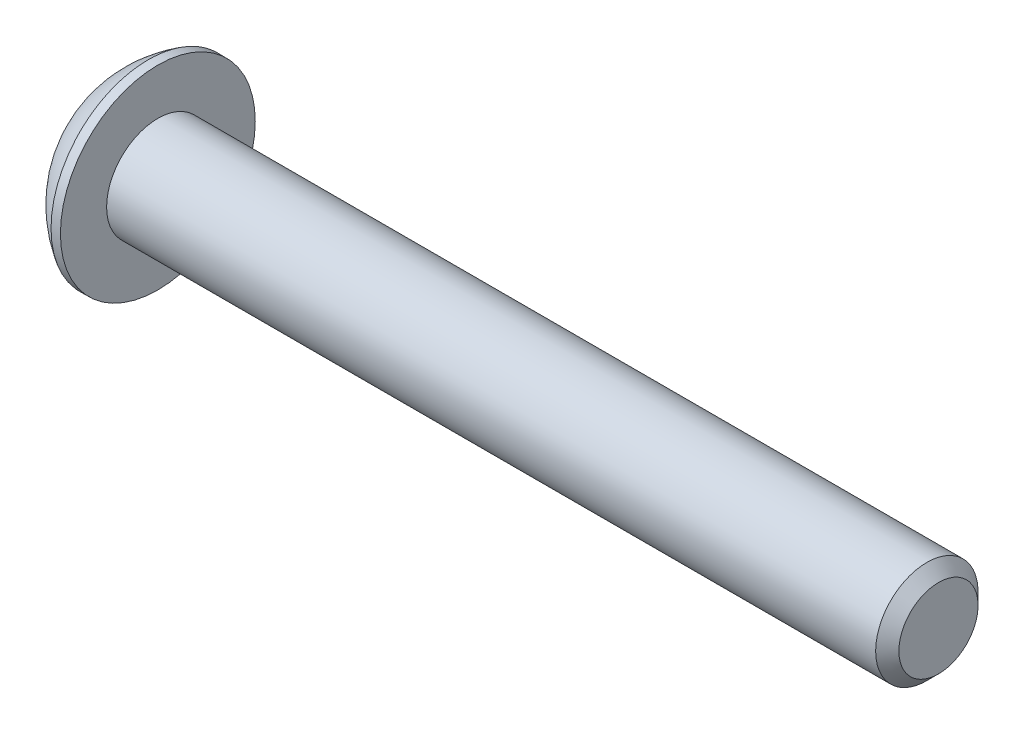
ISO-10303-21;
HEADER;
FILE_DESCRIPTION(('STEP AP214'),'2;1');
FILE_NAME('part.step','',(''),(''),'','','');
FILE_SCHEMA(('AUTOMOTIVE_DESIGN { 1 0 10303 214 1 1 1 1 }'));
ENDSEC;
DATA;
#1=APPLICATION_CONTEXT('core data for automotive mechanical design processes');
#2=APPLICATION_PROTOCOL_DEFINITION('international standard','automotive_design',2000,#1);
#3=PRODUCT_CONTEXT('',#1,'mechanical');
#4=PRODUCT('Part','Part','',(#3));
#5=PRODUCT_RELATED_PRODUCT_CATEGORY('part','',(#4));
#6=PRODUCT_DEFINITION_FORMATION('','',#4);
#7=PRODUCT_DEFINITION_CONTEXT('part definition',#1,'design');
#8=PRODUCT_DEFINITION('design','',#6,#7);
#9=PRODUCT_DEFINITION_SHAPE('','',#8);
#10=(LENGTH_UNIT() NAMED_UNIT(*) SI_UNIT(.MILLI.,.METRE.));
#11=(NAMED_UNIT(*) PLANE_ANGLE_UNIT() SI_UNIT($,.RADIAN.));
#12=(NAMED_UNIT(*) SI_UNIT($,.STERADIAN.) SOLID_ANGLE_UNIT());
#13=UNCERTAINTY_MEASURE_WITH_UNIT(LENGTH_MEASURE(1.E-05),#10,'distance_accuracy_value','');
#14=(GEOMETRIC_REPRESENTATION_CONTEXT(3) GLOBAL_UNCERTAINTY_ASSIGNED_CONTEXT((#13)) GLOBAL_UNIT_ASSIGNED_CONTEXT((#10,
#11,#12)) REPRESENTATION_CONTEXT('',''));
#15=CARTESIAN_POINT('',(0.,0.,0.));
#16=DIRECTION('',(0.,0.,1.));
#17=DIRECTION('',(1.,0.,0.));
#18=AXIS2_PLACEMENT_3D('',#15,#16,#17);
#19=CARTESIAN_POINT('',(1.32080000000034,0.,0.));
#20=DIRECTION('',(-1.,0.,0.));
#21=DIRECTION('',(0.,0.,1.));
#22=AXIS2_PLACEMENT_3D('',#19,#20,#21);
#23=CONICAL_SURFACE('',#22,1.1937999999998,1.04719755119608);
#24=CARTESIAN_POINT('',(2.01004075135902,0.,4.44089209850063E-13));
#25=VERTEX_POINT('',#24);
#26=VERTEX_LOOP('',#25);
#27=FACE_BOUND('',#26,.T.);
#28=CARTESIAN_POINT('',(1.32080000000009,0.,0.));
#29=DIRECTION('',(-1.,0.,0.));
#30=DIRECTION('',(0.,0.,1.));
#31=AXIS2_PLACEMENT_3D('',#28,#29,#30);
#32=CIRCLE('',#31,1.19380000000024);
#33=CARTESIAN_POINT('',(1.32080000000004,-1.03386112703797,0.596900000000061));
#34=VERTEX_POINT('',#33);
#35=CARTESIAN_POINT('',(1.32080000000004,0.,1.19380000000012));
#36=VERTEX_POINT('',#35);
#37=EDGE_CURVE('E20',#34,#36,#32,.T.);
#38=ORIENTED_EDGE('',*,*,#37,.T.);
#39=CARTESIAN_POINT('',(1.32080000000009,0.,0.));
#40=DIRECTION('',(-1.,0.,0.));
#41=DIRECTION('',(0.,0.,1.));
#42=AXIS2_PLACEMENT_3D('',#39,#40,#41);
#43=CIRCLE('',#42,1.19380000000024);
#44=CARTESIAN_POINT('',(1.32080000000004,1.03386112703797,0.59690000000006));
#45=VERTEX_POINT('',#44);
#46=EDGE_CURVE('E148',#36,#45,#43,.T.);
#47=ORIENTED_EDGE('',*,*,#46,.T.);
#48=CARTESIAN_POINT('',(1.32080000000009,0.,0.));
#49=DIRECTION('',(-1.,0.,0.));
#50=DIRECTION('',(0.,0.,1.));
#51=AXIS2_PLACEMENT_3D('',#48,#49,#50);
#52=CIRCLE('',#51,1.19380000000024);
#53=CARTESIAN_POINT('',(1.32080000000004,1.03386112703797,-0.59690000000006));
#54=VERTEX_POINT('',#53);
#55=EDGE_CURVE('E445',#45,#54,#52,.T.);
#56=ORIENTED_EDGE('',*,*,#55,.T.);
#57=CARTESIAN_POINT('',(1.32080000000009,0.,0.));
#58=DIRECTION('',(-1.,0.,0.));
#59=DIRECTION('',(0.,0.,1.));
#60=AXIS2_PLACEMENT_3D('',#57,#58,#59);
#61=CIRCLE('',#60,1.19380000000024);
#62=CARTESIAN_POINT('',(1.32080000000004,1.49457637585666E-12,-1.19380000000012));
#63=VERTEX_POINT('',#62);
#64=EDGE_CURVE('E446',#54,#63,#61,.T.);
#65=ORIENTED_EDGE('',*,*,#64,.T.);
#66=CARTESIAN_POINT('',(1.32080000000009,0.,0.));
#67=DIRECTION('',(-1.,0.,0.));
#68=DIRECTION('',(0.,0.,1.));
#69=AXIS2_PLACEMENT_3D('',#66,#67,#68);
#70=CIRCLE('',#69,1.19380000000024);
#71=CARTESIAN_POINT('',(1.32080000000004,-1.03386112703797,-0.596900000000061));
#72=VERTEX_POINT('',#71);
#73=EDGE_CURVE('E93',#63,#72,#70,.T.);
#74=ORIENTED_EDGE('',*,*,#73,.T.);
#75=CARTESIAN_POINT('',(1.32080000000009,0.,0.));
#76=DIRECTION('',(-1.,0.,0.));
#77=DIRECTION('',(0.,0.,1.));
#78=AXIS2_PLACEMENT_3D('',#75,#76,#77);
#79=CIRCLE('',#78,1.19380000000024);
#80=EDGE_CURVE('E89',#72,#34,#79,.T.);
#81=ORIENTED_EDGE('',*,*,#80,.T.);
#82=EDGE_LOOP('',(#38,#47,#56,#65,#74,#81));
#83=FACE_BOUND('',#82,.T.);
#84=ADVANCED_FACE('F17',(#27,#83),#23,.F.);
#85=CARTESIAN_POINT('',(1.3208,-2.06772225407573,-1.1938));
#86=DIRECTION('',(1.,0.,0.));
#87=DIRECTION('',(0.,0.,-1.));
#88=AXIS2_PLACEMENT_3D('',#85,#86,#87);
#89=PLANE('',#88);
#90=DIRECTION('',(0.,0.5,0.866025403784439));
#91=VECTOR('',#90,1.);
#92=CARTESIAN_POINT('',(1.3208,-1.37848150271715,0.));
#93=LINE('',#92,#91);
#94=CARTESIAN_POINT('',(1.3208,-0.689240751358575,1.1938));
#95=VERTEX_POINT('',#94);
#96=EDGE_CURVE('E101',#95,#34,#93,.F.);
#97=ORIENTED_EDGE('',*,*,#96,.F.);
#98=DIRECTION('',(0.,1.,0.));
#99=VECTOR('',#98,1.);
#100=CARTESIAN_POINT('',(1.3208,-0.689240751358575,1.1938));
#101=LINE('',#100,#99);
#102=EDGE_CURVE('E103',#36,#95,#101,.F.);
#103=ORIENTED_EDGE('',*,*,#102,.F.);
#104=ORIENTED_EDGE('',*,*,#37,.F.);
#105=EDGE_LOOP('',(#97,#103,#104));
#106=FACE_BOUND('',#105,.T.);
#107=ADVANCED_FACE('F99',(#106),#89,.F.);
#108=CARTESIAN_POINT('',(1.3208,-2.06772225407573,-1.1938));
#109=DIRECTION('',(1.,0.,0.));
#110=DIRECTION('',(0.,0.,-1.));
#111=AXIS2_PLACEMENT_3D('',#108,#109,#110);
#112=PLANE('',#111);
#113=DIRECTION('',(0.,-0.5,0.866025403784439));
#114=VECTOR('',#113,1.);
#115=CARTESIAN_POINT('',(1.3208,-0.689240751358575,-1.1938));
#116=LINE('',#115,#114);
#117=CARTESIAN_POINT('',(1.3208,-1.37848150271715,0.));
#118=VERTEX_POINT('',#117);
#119=EDGE_CURVE('E109',#118,#72,#116,.F.);
#120=ORIENTED_EDGE('',*,*,#119,.F.);
#121=DIRECTION('',(0.,0.5,0.866025403784439));
#122=VECTOR('',#121,1.);
#123=CARTESIAN_POINT('',(1.3208,-1.37848150271715,0.));
#124=LINE('',#123,#122);
#125=EDGE_CURVE('E106',#34,#118,#124,.F.);
#126=ORIENTED_EDGE('',*,*,#125,.F.);
#127=ORIENTED_EDGE('',*,*,#80,.F.);
#128=EDGE_LOOP('',(#120,#126,#127));
#129=FACE_BOUND('',#128,.T.);
#130=ADVANCED_FACE('F107',(#129),#112,.F.);
#131=CARTESIAN_POINT('',(1.3208,-2.06772225407573,-1.1938));
#132=DIRECTION('',(1.,0.,0.));
#133=DIRECTION('',(0.,0.,-1.));
#134=AXIS2_PLACEMENT_3D('',#131,#132,#133);
#135=PLANE('',#134);
#136=DIRECTION('',(0.,1.,0.));
#137=VECTOR('',#136,1.);
#138=CARTESIAN_POINT('',(1.3208,0.689240751358575,-1.1938));
#139=LINE('',#138,#137);
#140=CARTESIAN_POINT('',(1.3208,-0.689240751358575,-1.1938));
#141=VERTEX_POINT('',#140);
#142=EDGE_CURVE('E416',#141,#63,#139,.T.);
#143=ORIENTED_EDGE('',*,*,#142,.F.);
#144=DIRECTION('',(0.,-0.5,0.866025403784439));
#145=VECTOR('',#144,1.);
#146=CARTESIAN_POINT('',(1.3208,-0.689240751358575,-1.1938));
#147=LINE('',#146,#145);
#148=EDGE_CURVE('E428',#72,#141,#147,.F.);
#149=ORIENTED_EDGE('',*,*,#148,.F.);
#150=ORIENTED_EDGE('',*,*,#73,.F.);
#151=EDGE_LOOP('',(#143,#149,#150));
#152=FACE_BOUND('',#151,.T.);
#153=ADVANCED_FACE('F191',(#152),#135,.F.);
#154=CARTESIAN_POINT('',(1.3208,-2.06772225407573,-1.1938));
#155=DIRECTION('',(1.,0.,0.));
#156=DIRECTION('',(0.,0.,-1.));
#157=AXIS2_PLACEMENT_3D('',#154,#155,#156);
#158=PLANE('',#157);
#159=DIRECTION('',(0.,-0.499999999999999,-0.866025403784439));
#160=VECTOR('',#159,1.);
#161=CARTESIAN_POINT('',(1.3208,1.37848150271715,0.));
#162=LINE('',#161,#160);
#163=CARTESIAN_POINT('',(1.3208,0.689240751358575,-1.1938));
#164=VERTEX_POINT('',#163);
#165=EDGE_CURVE('E402',#164,#54,#162,.F.);
#166=ORIENTED_EDGE('',*,*,#165,.F.);
#167=DIRECTION('',(0.,1.,0.));
#168=VECTOR('',#167,1.);
#169=CARTESIAN_POINT('',(1.3208,0.689240751358575,-1.1938));
#170=LINE('',#169,#168);
#171=EDGE_CURVE('E413',#63,#164,#170,.T.);
#172=ORIENTED_EDGE('',*,*,#171,.F.);
#173=ORIENTED_EDGE('',*,*,#64,.F.);
#174=EDGE_LOOP('',(#166,#172,#173));
#175=FACE_BOUND('',#174,.T.);
#176=ADVANCED_FACE('F187',(#175),#158,.F.);
#177=CARTESIAN_POINT('',(1.3208,-2.06772225407573,-1.1938));
#178=DIRECTION('',(1.,0.,0.));
#179=DIRECTION('',(0.,0.,-1.));
#180=AXIS2_PLACEMENT_3D('',#177,#178,#179);
#181=PLANE('',#180);
#182=DIRECTION('',(0.,0.499999999999999,-0.866025403784439));
#183=VECTOR('',#182,1.);
#184=CARTESIAN_POINT('',(1.3208,0.689240751358575,1.1938));
#185=LINE('',#184,#183);
#186=CARTESIAN_POINT('',(1.3208,1.37848150271715,0.));
#187=VERTEX_POINT('',#186);
#188=EDGE_CURVE('E381',#187,#45,#185,.F.);
#189=ORIENTED_EDGE('',*,*,#188,.F.);
#190=DIRECTION('',(0.,-0.499999999999999,-0.866025403784439));
#191=VECTOR('',#190,1.);
#192=CARTESIAN_POINT('',(1.3208,1.37848150271715,0.));
#193=LINE('',#192,#191);
#194=EDGE_CURVE('E400',#54,#187,#193,.F.);
#195=ORIENTED_EDGE('',*,*,#194,.F.);
#196=ORIENTED_EDGE('',*,*,#55,.F.);
#197=EDGE_LOOP('',(#189,#195,#196));
#198=FACE_BOUND('',#197,.T.);
#199=ADVANCED_FACE('F183',(#198),#181,.F.);
#200=CARTESIAN_POINT('',(1.3208,-2.06772225407573,-1.1938));
#201=DIRECTION('',(1.,0.,0.));
#202=DIRECTION('',(0.,0.,-1.));
#203=AXIS2_PLACEMENT_3D('',#200,#201,#202);
#204=PLANE('',#203);
#205=DIRECTION('',(0.,1.,0.));
#206=VECTOR('',#205,1.);
#207=CARTESIAN_POINT('',(1.3208,-0.689240751358575,1.1938));
#208=LINE('',#207,#206);
#209=CARTESIAN_POINT('',(1.3208,0.689240751358575,1.1938));
#210=VERTEX_POINT('',#209);
#211=EDGE_CURVE('E118',#210,#36,#208,.F.);
#212=ORIENTED_EDGE('',*,*,#211,.F.);
#213=DIRECTION('',(0.,0.499999999999999,-0.866025403784439));
#214=VECTOR('',#213,1.);
#215=CARTESIAN_POINT('',(1.3208,0.689240751358575,1.1938));
#216=LINE('',#215,#214);
#217=EDGE_CURVE('E384',#45,#210,#216,.F.);
#218=ORIENTED_EDGE('',*,*,#217,.F.);
#219=ORIENTED_EDGE('',*,*,#46,.F.);
#220=EDGE_LOOP('',(#212,#218,#219));
#221=FACE_BOUND('',#220,.T.);
#222=ADVANCED_FACE('F179',(#221),#204,.F.);
#223=CARTESIAN_POINT('',(1.3208,-0.689240751358575,1.1938));
#224=DIRECTION('',(0.,0.,-1.));
#225=DIRECTION('',(0.,1.,0.));
#226=AXIS2_PLACEMENT_3D('',#223,#224,#225);
#227=PLANE('',#226);
#228=DIRECTION('',(0.,1.,0.));
#229=VECTOR('',#228,1.);
#230=CARTESIAN_POINT('',(0.,0.,1.1938));
#231=LINE('',#230,#229);
#232=CARTESIAN_POINT('',(0.,0.689240751358575,1.1938));
#233=VERTEX_POINT('',#232);
#234=CARTESIAN_POINT('',(0.,-0.689240751358575,1.1938));
#235=VERTEX_POINT('',#234);
#236=EDGE_CURVE('E378',#233,#235,#231,.F.);
#237=ORIENTED_EDGE('',*,*,#236,.F.);
#238=DIRECTION('',(1.,0.,0.));
#239=VECTOR('',#238,1.);
#240=CARTESIAN_POINT('',(1.3208,0.689240751358575,1.1938));
#241=LINE('',#240,#239);
#242=EDGE_CURVE('E390',#210,#233,#241,.F.);
#243=ORIENTED_EDGE('',*,*,#242,.F.);
#244=ORIENTED_EDGE('',*,*,#211,.T.);
#245=ORIENTED_EDGE('',*,*,#102,.T.);
#246=DIRECTION('',(1.,0.,0.));
#247=VECTOR('',#246,1.);
#248=CARTESIAN_POINT('',(1.3208,-0.689240751358575,1.1938));
#249=LINE('',#248,#247);
#250=EDGE_CURVE('E112',#235,#95,#249,.T.);
#251=ORIENTED_EDGE('',*,*,#250,.F.);
#252=EDGE_LOOP('',(#237,#243,#244,#245,#251));
#253=FACE_BOUND('',#252,.T.);
#254=ADVANCED_FACE('F176',(#253),#227,.T.);
#255=CARTESIAN_POINT('',(1.3208,-1.37848150271715,0.));
#256=DIRECTION('',(0.,0.866025403784439,-0.5));
#257=DIRECTION('',(0.,0.5,0.866025403784439));
#258=AXIS2_PLACEMENT_3D('',#255,#256,#257);
#259=PLANE('',#258);
#260=DIRECTION('',(0.,-0.5,-0.866025403784439));
#261=VECTOR('',#260,1.);
#262=CARTESIAN_POINT('',(0.,-0.689240751358575,1.1938));
#263=LINE('',#262,#261);
#264=CARTESIAN_POINT('',(0.,-1.37848150271715,0.));
#265=VERTEX_POINT('',#264);
#266=EDGE_CURVE('E375',#235,#265,#263,.T.);
#267=ORIENTED_EDGE('',*,*,#266,.F.);
#268=ORIENTED_EDGE('',*,*,#250,.T.);
#269=ORIENTED_EDGE('',*,*,#96,.T.);
#270=ORIENTED_EDGE('',*,*,#125,.T.);
#271=DIRECTION('',(1.,0.,0.));
#272=VECTOR('',#271,1.);
#273=CARTESIAN_POINT('',(1.3208,-1.37848150271715,0.));
#274=LINE('',#273,#272);
#275=EDGE_CURVE('E425',#265,#118,#274,.T.);
#276=ORIENTED_EDGE('',*,*,#275,.F.);
#277=EDGE_LOOP('',(#267,#268,#269,#270,#276));
#278=FACE_BOUND('',#277,.T.);
#279=ADVANCED_FACE('F116',(#278),#259,.T.);
#280=CARTESIAN_POINT('',(1.3208,-0.689240751358575,-1.1938));
#281=DIRECTION('',(0.,0.866025403784439,0.5));
#282=DIRECTION('',(0.,-0.5,0.866025403784439));
#283=AXIS2_PLACEMENT_3D('',#280,#281,#282);
#284=PLANE('',#283);
#285=DIRECTION('',(0.,0.5,-0.866025403784439));
#286=VECTOR('',#285,1.);
#287=CARTESIAN_POINT('',(0.,-1.37848150271715,0.));
#288=LINE('',#287,#286);
#289=CARTESIAN_POINT('',(0.,-0.689240751358575,-1.1938));
#290=VERTEX_POINT('',#289);
#291=EDGE_CURVE('E372',#265,#290,#288,.T.);
#292=ORIENTED_EDGE('',*,*,#291,.F.);
#293=ORIENTED_EDGE('',*,*,#275,.T.);
#294=ORIENTED_EDGE('',*,*,#119,.T.);
#295=ORIENTED_EDGE('',*,*,#148,.T.);
#296=DIRECTION('',(1.,0.,0.));
#297=VECTOR('',#296,1.);
#298=CARTESIAN_POINT('',(1.3208,-0.689240751358575,-1.1938));
#299=LINE('',#298,#297);
#300=EDGE_CURVE('E410',#290,#141,#299,.T.);
#301=ORIENTED_EDGE('',*,*,#300,.F.);
#302=EDGE_LOOP('',(#292,#293,#294,#295,#301));
#303=FACE_BOUND('',#302,.T.);
#304=ADVANCED_FACE('F169',(#303),#284,.T.);
#305=CARTESIAN_POINT('',(1.3208,0.689240751358575,-1.1938));
#306=DIRECTION('',(0.,0.,1.));
#307=DIRECTION('',(1.,0.,0.));
#308=AXIS2_PLACEMENT_3D('',#305,#306,#307);
#309=PLANE('',#308);
#310=DIRECTION('',(0.,1.,0.));
#311=VECTOR('',#310,1.);
#312=CARTESIAN_POINT('',(0.,0.,-1.1938));
#313=LINE('',#312,#311);
#314=CARTESIAN_POINT('',(0.,0.689240751358575,-1.1938));
#315=VERTEX_POINT('',#314);
#316=EDGE_CURVE('E369',#290,#315,#313,.T.);
#317=ORIENTED_EDGE('',*,*,#316,.F.);
#318=ORIENTED_EDGE('',*,*,#300,.T.);
#319=ORIENTED_EDGE('',*,*,#142,.T.);
#320=ORIENTED_EDGE('',*,*,#171,.T.);
#321=DIRECTION('',(1.,0.,0.));
#322=VECTOR('',#321,1.);
#323=CARTESIAN_POINT('',(1.3208,0.689240751358575,-1.1938));
#324=LINE('',#323,#322);
#325=EDGE_CURVE('E385',#315,#164,#324,.T.);
#326=ORIENTED_EDGE('',*,*,#325,.F.);
#327=EDGE_LOOP('',(#317,#318,#319,#320,#326));
#328=FACE_BOUND('',#327,.T.);
#329=ADVANCED_FACE('F166',(#328),#309,.T.);
#330=CARTESIAN_POINT('',(1.3208,1.37848150271715,0.));
#331=DIRECTION('',(0.,-0.866025403784439,0.499999999999999));
#332=DIRECTION('',(0.,-0.499999999999999,-0.866025403784439));
#333=AXIS2_PLACEMENT_3D('',#330,#331,#332);
#334=PLANE('',#333);
#335=DIRECTION('',(0.,0.499999999999999,0.866025403784439));
#336=VECTOR('',#335,1.);
#337=CARTESIAN_POINT('',(0.,0.689240751358575,-1.1938));
#338=LINE('',#337,#336);
#339=CARTESIAN_POINT('',(0.,1.37848150271715,0.));
#340=VERTEX_POINT('',#339);
#341=EDGE_CURVE('E366',#315,#340,#338,.T.);
#342=ORIENTED_EDGE('',*,*,#341,.F.);
#343=ORIENTED_EDGE('',*,*,#325,.T.);
#344=ORIENTED_EDGE('',*,*,#165,.T.);
#345=ORIENTED_EDGE('',*,*,#194,.T.);
#346=DIRECTION('',(1.,0.,0.));
#347=VECTOR('',#346,1.);
#348=CARTESIAN_POINT('',(1.3208,1.37848150271715,0.));
#349=LINE('',#348,#347);
#350=EDGE_CURVE('E35',#340,#187,#349,.T.);
#351=ORIENTED_EDGE('',*,*,#350,.F.);
#352=EDGE_LOOP('',(#342,#343,#344,#345,#351));
#353=FACE_BOUND('',#352,.T.);
#354=ADVANCED_FACE('F162',(#353),#334,.T.);
#355=CARTESIAN_POINT('',(1.3208,0.689240751358575,1.1938));
#356=DIRECTION('',(0.,-0.866025403784439,-0.499999999999999));
#357=DIRECTION('',(0.,0.499999999999999,-0.866025403784439));
#358=AXIS2_PLACEMENT_3D('',#355,#356,#357);
#359=PLANE('',#358);
#360=DIRECTION('',(0.,-0.499999999999999,0.866025403784439));
#361=VECTOR('',#360,1.);
#362=CARTESIAN_POINT('',(0.,1.37848150271715,0.));
#363=LINE('',#362,#361);
#364=EDGE_CURVE('E147',#340,#233,#363,.T.);
#365=ORIENTED_EDGE('',*,*,#364,.F.);
#366=ORIENTED_EDGE('',*,*,#350,.T.);
#367=ORIENTED_EDGE('',*,*,#188,.T.);
#368=ORIENTED_EDGE('',*,*,#217,.T.);
#369=ORIENTED_EDGE('',*,*,#242,.T.);
#370=EDGE_LOOP('',(#365,#366,#367,#368,#369));
#371=FACE_BOUND('',#370,.T.);
#372=ADVANCED_FACE('F158',(#371),#359,.T.);
#373=CARTESIAN_POINT('',(0.,0.,0.));
#374=DIRECTION('',(-1.,0.,0.));
#375=DIRECTION('',(0.,0.,1.));
#376=AXIS2_PLACEMENT_3D('',#373,#374,#375);
#377=PLANE('',#376);
#378=ORIENTED_EDGE('',*,*,#341,.T.);
#379=ORIENTED_EDGE('',*,*,#364,.T.);
#380=ORIENTED_EDGE('',*,*,#236,.T.);
#381=ORIENTED_EDGE('',*,*,#266,.T.);
#382=ORIENTED_EDGE('',*,*,#291,.T.);
#383=ORIENTED_EDGE('',*,*,#316,.T.);
#384=EDGE_LOOP('',(#378,#379,#380,#381,#382,#383));
#385=FACE_BOUND('',#384,.T.);
#386=CARTESIAN_POINT('',(0.,1.9812,0.));
#387=CARTESIAN_POINT('',(0.,1.9811996664299,0.0556258831179427));
#388=CARTESIAN_POINT('',(0.,1.97885520380442,0.111261989398606));
#389=CARTESIAN_POINT('',(0.,1.96949260169541,0.222149719830457));
#390=CARTESIAN_POINT('',(0.,1.96247308239605,0.277401225602895));
#391=CARTESIAN_POINT('',(0.,1.94379192841038,0.387209508139748));
#392=CARTESIAN_POINT('',(-1.85684713606366E-13,1.93212292489526,0.441765039546365));
#393=CARTESIAN_POINT('',(1.86703426467969E-13,1.90422331175315,0.549729449347493));
#394=CARTESIAN_POINT('',(6.95912300261454E-13,1.88798900035338,0.60313735920887));
#395=CARTESIAN_POINT('',(1.15748432216766E-12,1.83266214476501,0.760839131321829));
#396=CARTESIAN_POINT('',(0.,1.78690023648845,0.862876433575429));
#397=CARTESIAN_POINT('',(0.,1.67887358150667,1.05780719540872));
#398=CARTESIAN_POINT('',(9.54133844997183E-13,1.6166082074585,1.15070030720801));
#399=CARTESIAN_POINT('',(5.94835315740768E-13,1.51224157140982,1.28116890915698));
#400=CARTESIAN_POINT('',(1.63152335675163E-13,1.4755970394354,1.32320451127027));
#401=CARTESIAN_POINT('',(-1.62128088646011E-13,1.39893832619713,1.40400288695709));
#402=CARTESIAN_POINT('',(0.,1.35892742784699,1.44276877695455));
#403=CARTESIAN_POINT('',(1.13752532132066E-13,1.23416504602197,1.55382272417904));
#404=CARTESIAN_POINT('',(0.,1.14466125559859,1.62089527952111));
#405=CARTESIAN_POINT('',(0.,0.95571214417816,1.73902218081179));
#406=CARTESIAN_POINT('',(0.,0.856267198233559,1.79007713076007));
#407=CARTESIAN_POINT('',(0.,0.650206345910839,1.87477637530954));
#408=CARTESIAN_POINT('',(0.,0.543590516134851,1.90842085586267));
#409=CARTESIAN_POINT('',(0.,0.326226155292014,1.95733039300656));
#410=CARTESIAN_POINT('',(0.,0.215477602157926,1.97259535144288));
#411=CARTESIAN_POINT('',(0.,-0.00701040587545038,1.98431697865418));
#412=CARTESIAN_POINT('',(0.,-0.118749860774738,1.98077364742917));
#413=CARTESIAN_POINT('',(0.,-0.340050178355489,1.95497485623825));
#414=CARTESIAN_POINT('',(0.,-0.449611052668259,1.93271949620218));
#415=CARTESIAN_POINT('',(0.,-0.663431110729178,1.87014138774524));
#416=CARTESIAN_POINT('',(0.,-0.767690237838526,1.82981844635272));
#417=CARTESIAN_POINT('',(0.,-0.968005760719351,1.73219968377097));
#418=CARTESIAN_POINT('',(0.,-1.0640618469811,1.6749032225164));
#419=CARTESIAN_POINT('',(0.,-1.19980276751284,1.57757371205873));
#420=CARTESIAN_POINT('',(0.,-1.24366557129214,1.54322665019466));
#421=CARTESIAN_POINT('',(0.,-1.32838995706696,1.47093063174264));
#422=CARTESIAN_POINT('',(0.,-1.36924860178707,1.4329782310244));
#423=CARTESIAN_POINT('',(0.,-1.48674671849224,1.31419842051173));
#424=CARTESIAN_POINT('',(0.,-1.55842832343237,1.22836221289311));
#425=CARTESIAN_POINT('',(0.,-1.6863396856475,1.04586168272493));
#426=CARTESIAN_POINT('',(0.,-1.74257003024881,0.949197771949777));
#427=CARTESIAN_POINT('',(0.,-1.81416142504011,0.798182600298686));
#428=CARTESIAN_POINT('',(0.,-1.83591780585876,0.746776203847792));
#429=CARTESIAN_POINT('',(0.,-1.87500754181093,0.642341081688636));
#430=CARTESIAN_POINT('',(0.,-1.89234447645405,0.589313708122847));
#431=CARTESIAN_POINT('',(0.,-1.92246053433555,0.482076273028395));
#432=CARTESIAN_POINT('',(0.,-1.93524685475119,0.427868224257511));
#433=CARTESIAN_POINT('',(0.,-1.95620937250495,0.318578151844612));
#434=CARTESIAN_POINT('',(0.,-1.96438692958148,0.263496390912872));
#435=CARTESIAN_POINT('',(0.,-1.97388528284654,0.173607715038558));
#436=CARTESIAN_POINT('',(0.,-1.97662743364427,0.138944718024998));
#437=CARTESIAN_POINT('',(0.,-1.98028489645284,0.0695224782567004));
#438=CARTESIAN_POINT('',(0.,-1.98120020846368,0.0347632355019632));
#439=CARTESIAN_POINT('',(0.,-1.98119966642991,-0.0556258831179439));
#440=CARTESIAN_POINT('',(0.,-1.97885520380443,-0.111261989398607));
#441=CARTESIAN_POINT('',(0.,-1.96949260169542,-0.222149719830459));
#442=CARTESIAN_POINT('',(0.,-1.96247308239606,-0.277401225602897));
#443=CARTESIAN_POINT('',(0.,-1.9437919284104,-0.387209508139749));
#444=CARTESIAN_POINT('',(-1.85663518818529E-13,-1.93212292489527,-0.441765039546366));
#445=CARTESIAN_POINT('',(1.8668221444457E-13,-1.90422331175316,-0.549729449347494));
#446=CARTESIAN_POINT('',(6.95851299742614E-13,-1.88798900035339,-0.603137359208871));
#447=CARTESIAN_POINT('',(1.15760603242308E-12,-1.83266214476502,-0.76083913132183));
#448=CARTESIAN_POINT('',(0.,-1.78690023648846,-0.86287643357543));
#449=CARTESIAN_POINT('',(0.,-1.67887358150668,-1.05780719540872));
#450=CARTESIAN_POINT('',(9.51676789209375E-13,-1.61660820745851,-1.15070030720801));
#451=CARTESIAN_POINT('',(5.93462231683297E-13,-1.51224157140983,-1.28116890915698));
#452=CARTESIAN_POINT('',(1.62776229463016E-13,-1.47559703943541,-1.32320451127027));
#453=CARTESIAN_POINT('',(-1.61752345056899E-13,-1.39893832619714,-1.40400288695709));
#454=CARTESIAN_POINT('',(0.,-1.35892742784699,-1.44276877695455));
#455=CARTESIAN_POINT('',(1.13488992312735E-13,-1.23416504602198,-1.55382272417904));
#456=CARTESIAN_POINT('',(0.,-1.1446612555986,-1.62089527952111));
#457=CARTESIAN_POINT('',(0.,-0.955712144178172,-1.7390221808118));
#458=CARTESIAN_POINT('',(0.,-0.856267198233569,-1.79007713076007));
#459=CARTESIAN_POINT('',(0.,-0.650206345910848,-1.87477637530954));
#460=CARTESIAN_POINT('',(0.,-0.54359051613486,-1.90842085586267));
#461=CARTESIAN_POINT('',(0.,-0.326226155292023,-1.95733039300656));
#462=CARTESIAN_POINT('',(0.,-0.215477602157935,-1.97259535144288));
#463=CARTESIAN_POINT('',(0.,0.00701040587544162,-1.98431697865418));
#464=CARTESIAN_POINT('',(0.,0.118749860774729,-1.98077364742916));
#465=CARTESIAN_POINT('',(0.,0.340050178355481,-1.95497485623824));
#466=CARTESIAN_POINT('',(0.,0.449611052668251,-1.93271949620218));
#467=CARTESIAN_POINT('',(0.,0.663431110729171,-1.87014138774524));
#468=CARTESIAN_POINT('',(0.,0.767690237838518,-1.82981844635273));
#469=CARTESIAN_POINT('',(0.,0.968005760719342,-1.73219968377097));
#470=CARTESIAN_POINT('',(0.,1.06406184698109,-1.6749032225164));
#471=CARTESIAN_POINT('',(0.,1.19980276751283,-1.57757371205873));
#472=CARTESIAN_POINT('',(0.,1.24366557129213,-1.54322665019466));
#473=CARTESIAN_POINT('',(0.,1.32838995706696,-1.47093063174264));
#474=CARTESIAN_POINT('',(0.,1.36924860178706,-1.4329782310244));
#475=CARTESIAN_POINT('',(0.,1.48674671849222,-1.31419842051173));
#476=CARTESIAN_POINT('',(0.,1.55842832343237,-1.22836221289311));
#477=CARTESIAN_POINT('',(0.,1.6863396856475,-1.04586168272493));
#478=CARTESIAN_POINT('',(0.,1.74257003024879,-0.949197771949774));
#479=CARTESIAN_POINT('',(0.,1.8141614250401,-0.798182600298684));
#480=CARTESIAN_POINT('',(0.,1.83591780585875,-0.746776203847791));
#481=CARTESIAN_POINT('',(0.,1.87500754181092,-0.642341081688635));
#482=CARTESIAN_POINT('',(0.,1.89234447645404,-0.589313708122846));
#483=CARTESIAN_POINT('',(0.,1.92246053433554,-0.482076273028394));
#484=CARTESIAN_POINT('',(0.,1.93524685475117,-0.42786822425751));
#485=CARTESIAN_POINT('',(0.,1.95620937250493,-0.318578151844611));
#486=CARTESIAN_POINT('',(0.,1.96438692958147,-0.263496390912871));
#487=CARTESIAN_POINT('',(0.,1.97388528284653,-0.173607715038558));
#488=CARTESIAN_POINT('',(0.,1.97662743364426,-0.138944718024998));
#489=CARTESIAN_POINT('',(0.,1.98028489645283,-0.0695224782567008));
#490=CARTESIAN_POINT('',(0.,1.98120020846367,-0.0347632355019639));
#491=CARTESIAN_POINT('',(0.,1.9812,0.));
#492=B_SPLINE_CURVE_WITH_KNOTS('',3,(#386,#387,#388,#389,#390,#391,#392,#393,#394,#395,#396,
#397,#398,#399,#400,#401,#402,#403,#404,#405,#406,#407,#408,#409,#410,#411,#412,#413,#414,#415,
#416,#417,#418,#419,#420,#421,#422,#423,#424,#425,#426,#427,#428,#429,#430,#431,#432,#433,#434,
#435,#436,#437,#438,#439,#440,#441,#442,#443,#444,#445,#446,#447,#448,#449,#450,#451,#452,#453,
#454,#455,#456,#457,#458,#459,#460,#461,#462,#463,#464,#465,#466,#467,#468,#469,#470,#471,#472,
#473,#474,#475,#476,#477,#478,#479,#480,#481,#482,#483,#484,#485,#486,#487,#488,#489,#490,#491),
.UNSPECIFIED.,.T.,.F.,(4,2,2,2,2,2,2,2,2,2,2,2,2,2,2,2,2,2,2,2,2,2,2,2,2,2,2,2,2,2,2,2,2,2,2,2,
2,2,2,2,2,2,2,2,2,2,2,2,2,2,2,2,4),(0.,0.166845646007828,0.333740557374255,0.500901034367693,
0.668197445942387,1.00199278686282,1.33580081809885,1.50292354032982,1.6698851310853,
2.00370118900129,2.33750465770544,2.67130456115909,3.00510624723801,3.33890793331696,
3.67270783677065,4.00651130547476,4.34032736339027,4.50728895414555,4.67441167637632,
5.0082197076126,5.34201504853333,5.50931146010828,5.67647193710192,5.84336684846845,
6.01021249447641,6.11448220058335,6.2187519066903,6.38559755269813,6.55249246406455,
6.71965294105799,6.88694935263269,7.22074469355312,7.55455272478916,7.72167544702012,
7.8886370377756,8.22245309569159,8.55625656439574,8.89005646784939,9.22385815392831,
9.55765984000726,9.89145974346095,10.2252632121651,10.5590792700806,10.7260408608358,
10.8931635830666,11.2269716143029,11.5607669552236,11.7280633667986,11.8952238437922,
12.0621187551587,12.2289644011667,12.3332341072736,12.4375038133806),.UNSPECIFIED.);
#493=CARTESIAN_POINT('',(0.,1.9812,0.));
#494=VERTEX_POINT('',#493);
#495=EDGE_CURVE('E140',#494,#494,#492,.T.);
#496=ORIENTED_EDGE('',*,*,#495,.F.);
#497=EDGE_LOOP('',(#496));
#498=FACE_BOUND('',#497,.T.);
#499=ADVANCED_FACE('F154',(#385,#498),#377,.T.);
#500=CARTESIAN_POINT('',(4.13385000000001,0.,0.));
#501=DIRECTION('',(0.,1.,0.));
#502=DIRECTION('',(1.,0.,0.));
#503=AXIS2_PLACEMENT_3D('',#500,#501,#502);
#504=SPHERICAL_SURFACE('',#503,4.5840887057844);
#505=CARTESIAN_POINT('',(1.8288,0.,0.));
#506=DIRECTION('',(-1.,0.,0.));
#507=DIRECTION('',(0.,0.,1.));
#508=AXIS2_PLACEMENT_3D('',#505,#506,#507);
#509=CIRCLE('',#508,3.9624);
#510=CARTESIAN_POINT('',(1.8288,0.,3.9624));
#511=VERTEX_POINT('',#510);
#512=EDGE_CURVE('E137',#511,#511,#509,.F.);
#513=ORIENTED_EDGE('',*,*,#512,.F.);
#514=EDGE_LOOP('',(#513));
#515=FACE_BOUND('',#514,.T.);
#516=ORIENTED_EDGE('',*,*,#495,.T.);
#517=EDGE_LOOP('',(#516));
#518=FACE_BOUND('',#517,.T.);
#519=ADVANCED_FACE('F150',(#515,#518),#504,.T.);
#520=CARTESIAN_POINT('',(33.9598,0.,0.));
#521=DIRECTION('',(-1.,0.,0.));
#522=DIRECTION('',(0.,0.,1.));
#523=AXIS2_PLACEMENT_3D('',#520,#521,#522);
#524=PLANE('',#523);
#525=CARTESIAN_POINT('',(33.9598000000478,0.,0.));
#526=DIRECTION('',(-1.,0.,0.));
#527=DIRECTION('',(0.,0.,1.));
#528=AXIS2_PLACEMENT_3D('',#525,#526,#527);
#529=CIRCLE('',#528,1.61035999997239);
#530=CARTESIAN_POINT('',(33.9598000000478,0.,1.61035999997239));
#531=VERTEX_POINT('',#530);
#532=EDGE_CURVE('E134',#531,#531,#529,.T.);
#533=ORIENTED_EDGE('',*,*,#532,.F.);
#534=EDGE_LOOP('',(#533));
#535=FACE_BOUND('',#534,.T.);
#536=ADVANCED_FACE('F221',(#535),#524,.F.);
#537=CARTESIAN_POINT('',(0.,0.,0.));
#538=DIRECTION('',(-1.,0.,0.));
#539=DIRECTION('',(0.,0.,1.));
#540=AXIS2_PLACEMENT_3D('',#537,#538,#539);
#541=CYLINDRICAL_SURFACE('',#540,3.9624);
#542=ORIENTED_EDGE('',*,*,#512,.T.);
#543=EDGE_LOOP('',(#542));
#544=FACE_BOUND('',#543,.T.);
#545=CARTESIAN_POINT('',(2.2098,0.,0.));
#546=DIRECTION('',(-1.,0.,0.));
#547=DIRECTION('',(0.,0.,1.));
#548=AXIS2_PLACEMENT_3D('',#545,#546,#547);
#549=CIRCLE('',#548,3.9624);
#550=CARTESIAN_POINT('',(2.2098,0.,3.9624));
#551=VERTEX_POINT('',#550);
#552=EDGE_CURVE('E131',#551,#551,#549,.T.);
#553=ORIENTED_EDGE('',*,*,#552,.T.);
#554=EDGE_LOOP('',(#553));
#555=FACE_BOUND('',#554,.T.);
#556=ADVANCED_FACE('F218',(#544,#555),#541,.T.);
#557=CARTESIAN_POINT('',(33.4873600000378,0.,0.));
#558=DIRECTION('',(-1.,0.,0.));
#559=DIRECTION('',(0.,0.,1.));
#560=AXIS2_PLACEMENT_3D('',#557,#558,#559);
#561=CONICAL_SURFACE('',#560,2.08279999992556,0.785398163337289);
#562=CARTESIAN_POINT('',(33.48736,0.,0.));
#563=DIRECTION('',(-1.,0.,0.));
#564=DIRECTION('',(0.,0.,1.));
#565=AXIS2_PLACEMENT_3D('',#562,#563,#564);
#566=CIRCLE('',#565,2.08279999999999);
#567=CARTESIAN_POINT('',(33.48736,0.,2.08279999999999));
#568=VERTEX_POINT('',#567);
#569=EDGE_CURVE('E26',#568,#568,#566,.T.);
#570=ORIENTED_EDGE('',*,*,#569,.F.);
#571=EDGE_LOOP('',(#570));
#572=FACE_BOUND('',#571,.T.);
#573=ORIENTED_EDGE('',*,*,#532,.T.);
#574=EDGE_LOOP('',(#573));
#575=FACE_BOUND('',#574,.T.);
#576=ADVANCED_FACE('F211',(#572,#575),#561,.T.);
#577=CARTESIAN_POINT('',(2.2098,2.08279999999999,0.));
#578=DIRECTION('',(-1.,0.,0.));
#579=DIRECTION('',(0.,0.,1.));
#580=AXIS2_PLACEMENT_3D('',#577,#578,#579);
#581=PLANE('',#580);
#582=CARTESIAN_POINT('',(2.2098,0.,0.));
#583=DIRECTION('',(-1.,0.,0.));
#584=DIRECTION('',(0.,0.,1.));
#585=AXIS2_PLACEMENT_3D('',#582,#583,#584);
#586=CIRCLE('',#585,2.08279999999999);
#587=CARTESIAN_POINT('',(2.2098,0.,2.08279999999999));
#588=VERTEX_POINT('',#587);
#589=EDGE_CURVE('E11',#588,#588,#586,.F.);
#590=ORIENTED_EDGE('',*,*,#589,.F.);
#591=EDGE_LOOP('',(#590));
#592=FACE_BOUND('',#591,.T.);
#593=ORIENTED_EDGE('',*,*,#552,.F.);
#594=EDGE_LOOP('',(#593));
#595=FACE_BOUND('',#594,.T.);
#596=ADVANCED_FACE('F205',(#592,#595),#581,.F.);
#597=CARTESIAN_POINT('',(0.,0.,0.));
#598=DIRECTION('',(-1.,0.,0.));
#599=DIRECTION('',(0.,0.,1.));
#600=AXIS2_PLACEMENT_3D('',#597,#598,#599);
#601=CYLINDRICAL_SURFACE('',#600,2.08279999999999);
#602=ORIENTED_EDGE('',*,*,#589,.T.);
#603=EDGE_LOOP('',(#602));
#604=FACE_BOUND('',#603,.T.);
#605=ORIENTED_EDGE('',*,*,#569,.T.);
#606=EDGE_LOOP('',(#605));
#607=FACE_BOUND('',#606,.T.);
#608=ADVANCED_FACE('F203',(#604,#607),#601,.T.);
#609=CLOSED_SHELL('',(#84,#107,#130,#153,#176,#199,#222,#254,#279,#304,#329,#354,#372,#499,#519,
#536,#556,#576,#596,#608));
#610=MANIFOLD_SOLID_BREP('B1',#609);
#611=ADVANCED_BREP_SHAPE_REPRESENTATION('',(#18,#610),#14);
#612=SHAPE_DEFINITION_REPRESENTATION(#9,#611);
ENDSEC;
END-ISO-10303-21;
